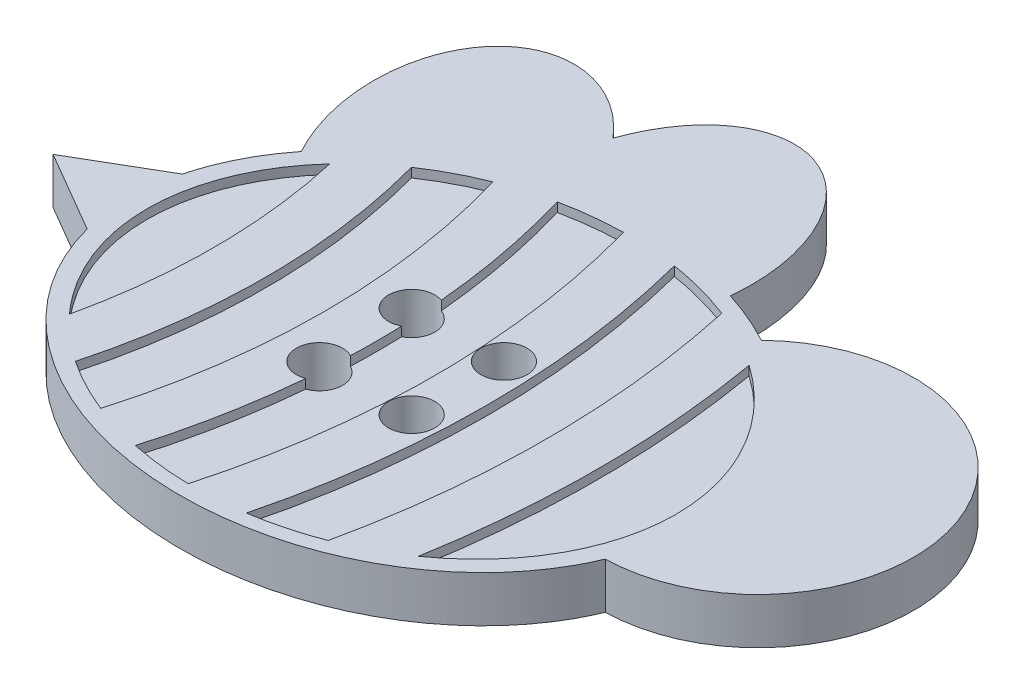
ISO-10303-21;
HEADER;
FILE_DESCRIPTION(('STEP AP214'),'2;1');
FILE_NAME('part.step','',(''),(''),'','','');
FILE_SCHEMA(('AUTOMOTIVE_DESIGN { 1 0 10303 214 1 1 1 1 }'));
ENDSEC;
DATA;
#1=APPLICATION_CONTEXT('core data for automotive mechanical design processes');
#2=APPLICATION_PROTOCOL_DEFINITION('international standard','automotive_design',2000,#1);
#3=PRODUCT_CONTEXT('',#1,'mechanical');
#4=PRODUCT('Part','Part','',(#3));
#5=PRODUCT_RELATED_PRODUCT_CATEGORY('part','',(#4));
#6=PRODUCT_DEFINITION_FORMATION('','',#4);
#7=PRODUCT_DEFINITION_CONTEXT('part definition',#1,'design');
#8=PRODUCT_DEFINITION('design','',#6,#7);
#9=PRODUCT_DEFINITION_SHAPE('','',#8);
#10=(LENGTH_UNIT() NAMED_UNIT(*) SI_UNIT(.MILLI.,.METRE.));
#11=(NAMED_UNIT(*) PLANE_ANGLE_UNIT() SI_UNIT($,.RADIAN.));
#12=(NAMED_UNIT(*) SI_UNIT($,.STERADIAN.) SOLID_ANGLE_UNIT());
#13=UNCERTAINTY_MEASURE_WITH_UNIT(LENGTH_MEASURE(1.E-05),#10,'distance_accuracy_value','');
#14=(GEOMETRIC_REPRESENTATION_CONTEXT(3) GLOBAL_UNCERTAINTY_ASSIGNED_CONTEXT((#13)) GLOBAL_UNIT_ASSIGNED_CONTEXT((#10,
#11,#12)) REPRESENTATION_CONTEXT('',''));
#15=CARTESIAN_POINT('',(0.,0.,0.));
#16=DIRECTION('',(0.,0.,1.));
#17=DIRECTION('',(1.,0.,0.));
#18=AXIS2_PLACEMENT_3D('',#15,#16,#17);
#19=CARTESIAN_POINT('',(-27.1187016034914,1.27,0.));
#20=DIRECTION('',(0.,1.,0.));
#21=DIRECTION('',(0.,0.,1.));
#22=AXIS2_PLACEMENT_3D('',#19,#20,#21);
#23=CYLINDRICAL_SURFACE('',#22,25.908);
#24=CARTESIAN_POINT('',(-27.1187016034914,1.5875,0.));
#25=DIRECTION('',(0.,-1.,0.));
#26=DIRECTION('',(0.,0.,1.));
#27=AXIS2_PLACEMENT_3D('',#24,#25,#26);
#28=CIRCLE('',#27,25.908);
#29=CARTESIAN_POINT('',(-1.22568542497171,1.5875,-0.881009182085779));
#30=VERTEX_POINT('',#29);
#31=CARTESIAN_POINT('',(-1.22568542497171,1.5875,0.881009182085776));
#32=VERTEX_POINT('',#31);
#33=EDGE_CURVE('E437',#30,#32,#28,.T.);
#34=ORIENTED_EDGE('',*,*,#33,.T.);
#35=DIRECTION('',(0.,1.,0.));
#36=VECTOR('',#35,1.);
#37=CARTESIAN_POINT('',(-1.22568542497172,0.793756,0.881009182085778));
#38=LINE('',#37,#36);
#39=CARTESIAN_POINT('',(-1.22568542497171,1.27,0.881009182085765));
#40=VERTEX_POINT('',#39);
#41=EDGE_CURVE('E633',#32,#40,#38,.F.);
#42=ORIENTED_EDGE('',*,*,#41,.T.);
#43=CARTESIAN_POINT('',(-27.1187016034914,1.27,0.));
#44=DIRECTION('',(0.,-1.,0.));
#45=DIRECTION('',(0.,0.,1.));
#46=AXIS2_PLACEMENT_3D('',#43,#44,#45);
#47=CIRCLE('',#46,25.908);
#48=CARTESIAN_POINT('',(-1.22568542497171,1.27,-0.881009182085765));
#49=VERTEX_POINT('',#48);
#50=EDGE_CURVE('E251',#49,#40,#47,.T.);
#51=ORIENTED_EDGE('',*,*,#50,.F.);
#52=DIRECTION('',(0.,1.,0.));
#53=VECTOR('',#52,1.);
#54=CARTESIAN_POINT('',(-1.22568542497172,0.793756,-0.881009182085778));
#55=LINE('',#54,#53);
#56=EDGE_CURVE('E63',#49,#30,#55,.T.);
#57=ORIENTED_EDGE('',*,*,#56,.T.);
#58=EDGE_LOOP('',(#34,#42,#51,#57));
#59=FACE_BOUND('',#58,.T.);
#60=ADVANCED_FACE('F39',(#59),#23,.T.);
#61=CARTESIAN_POINT('',(-2.24892880186877,1.5875,-7.26077577092648));
#62=VERTEX_POINT('',#61);
#63=CARTESIAN_POINT('',(-1.31599151362096,1.5875,-2.33337009882698));
#64=VERTEX_POINT('',#63);
#65=EDGE_CURVE('E241',#62,#64,#28,.T.);
#66=ORIENTED_EDGE('',*,*,#65,.T.);
#67=DIRECTION('',(0.,1.,0.));
#68=VECTOR('',#67,1.);
#69=CARTESIAN_POINT('',(-1.31599151362097,0.793756,-2.33337009882698));
#70=LINE('',#69,#68);
#71=CARTESIAN_POINT('',(-1.31599151362096,1.27,-2.33337009882699));
#72=VERTEX_POINT('',#71);
#73=EDGE_CURVE('E225',#64,#72,#70,.F.);
#74=ORIENTED_EDGE('',*,*,#73,.T.);
#75=CARTESIAN_POINT('',(-2.24892880186877,1.27,-7.26077577092648));
#76=VERTEX_POINT('',#75);
#77=EDGE_CURVE('E238',#76,#72,#47,.T.);
#78=ORIENTED_EDGE('',*,*,#77,.F.);
#79=DIRECTION('',(0.,1.,0.));
#80=VECTOR('',#79,1.);
#81=CARTESIAN_POINT('',(-2.24892880186877,1.27,-7.26077577092648));
#82=LINE('',#81,#80);
#83=EDGE_CURVE('E418',#76,#62,#82,.T.);
#84=ORIENTED_EDGE('',*,*,#83,.T.);
#85=EDGE_LOOP('',(#66,#74,#78,#84));
#86=FACE_BOUND('',#85,.T.);
#87=ADVANCED_FACE('F236',(#86),#23,.T.);
#88=CARTESIAN_POINT('',(0.,1.5875,0.));
#89=DIRECTION('',(0.,1.,0.));
#90=DIRECTION('',(0.,0.,1.));
#91=AXIS2_PLACEMENT_3D('',#88,#89,#90);
#92=PLANE('',#91);
#93=CARTESIAN_POINT('',(-1.5875,1.5875,1.5875));
#94=DIRECTION('',(0.,1.,0.));
#95=DIRECTION('',(0.,0.,1.));
#96=AXIS2_PLACEMENT_3D('',#93,#94,#95);
#97=CIRCLE('',#96,0.79375);
#98=CARTESIAN_POINT('',(-1.31599151362096,1.5875,2.33337009882698));
#99=VERTEX_POINT('',#98);
#100=EDGE_CURVE('E640',#32,#99,#97,.T.);
#101=ORIENTED_EDGE('',*,*,#100,.F.);
#102=ORIENTED_EDGE('',*,*,#33,.F.);
#103=CARTESIAN_POINT('',(-1.5875,1.5875,-1.5875));
#104=DIRECTION('',(0.,1.,0.));
#105=DIRECTION('',(0.,0.,1.));
#106=AXIS2_PLACEMENT_3D('',#103,#104,#105);
#107=CIRCLE('',#106,0.79375);
#108=EDGE_CURVE('E243',#64,#30,#107,.T.);
#109=ORIENTED_EDGE('',*,*,#108,.F.);
#110=ORIENTED_EDGE('',*,*,#65,.F.);
#111=CARTESIAN_POINT('',(0.,1.5875,0.));
#112=DIRECTION('',(0.,1.,0.));
#113=DIRECTION('',(1.,0.,0.));
#114=AXIS2_PLACEMENT_3D('',#111,#112,#113);
#115=ELLIPSE('',#114,9.10545943753928,7.49291504612029);
#116=CARTESIAN_POINT('',(-0.201655679950095,1.5875,-7.49107727566405));
#117=VERTEX_POINT('',#116);
#118=EDGE_CURVE('E439',#117,#62,#115,.T.);
#119=ORIENTED_EDGE('',*,*,#118,.F.);
#120=CARTESIAN_POINT('',(-27.1187016034914,1.5875,0.));
#121=DIRECTION('',(0.,1.,0.));
#122=DIRECTION('',(0.,0.,1.));
#123=AXIS2_PLACEMENT_3D('',#120,#121,#122);
#124=CIRCLE('',#123,27.94);
#125=CARTESIAN_POINT('',(-0.201655679950098,1.5875,7.49107727566404));
#126=VERTEX_POINT('',#125);
#127=EDGE_CURVE('E264',#126,#117,#124,.T.);
#128=ORIENTED_EDGE('',*,*,#127,.F.);
#129=CARTESIAN_POINT('',(0.,1.5875,0.));
#130=DIRECTION('',(0.,1.,0.));
#131=DIRECTION('',(1.,0.,0.));
#132=AXIS2_PLACEMENT_3D('',#129,#130,#131);
#133=ELLIPSE('',#132,9.10545943753928,7.49291504612029);
#134=CARTESIAN_POINT('',(-2.24892880186877,1.5875,7.26077577092648));
#135=VERTEX_POINT('',#134);
#136=EDGE_CURVE('E267',#135,#126,#133,.T.);
#137=ORIENTED_EDGE('',*,*,#136,.F.);
#138=EDGE_CURVE('E438',#99,#135,#28,.T.);
#139=ORIENTED_EDGE('',*,*,#138,.F.);
#140=EDGE_LOOP('',(#101,#102,#109,#110,#119,#128,#137,#139));
#141=FACE_BOUND('',#140,.T.);
#142=CARTESIAN_POINT('',(1.5875,1.5875,1.5875));
#143=DIRECTION('',(0.,1.,0.));
#144=DIRECTION('',(0.,0.,1.));
#145=AXIS2_PLACEMENT_3D('',#142,#143,#144);
#146=CIRCLE('',#145,0.79375);
#147=CARTESIAN_POINT('',(1.5875,1.5875,2.38125));
#148=VERTEX_POINT('',#147);
#149=EDGE_CURVE('E599',#148,#148,#146,.T.);
#150=ORIENTED_EDGE('',*,*,#149,.F.);
#151=EDGE_LOOP('',(#150));
#152=FACE_BOUND('',#151,.T.);
#153=CARTESIAN_POINT('',(1.5875,1.5875,-1.5875));
#154=DIRECTION('',(0.,1.,0.));
#155=DIRECTION('',(0.,0.,1.));
#156=AXIS2_PLACEMENT_3D('',#153,#154,#155);
#157=CIRCLE('',#156,0.79375);
#158=CARTESIAN_POINT('',(1.5875,1.5875,-0.79375));
#159=VERTEX_POINT('',#158);
#160=EDGE_CURVE('E642',#159,#159,#157,.T.);
#161=ORIENTED_EDGE('',*,*,#160,.F.);
#162=EDGE_LOOP('',(#161));
#163=FACE_BOUND('',#162,.T.);
#164=CARTESIAN_POINT('',(0.,1.5875,0.));
#165=DIRECTION('',(0.,1.,0.));
#166=DIRECTION('',(1.,0.,0.));
#167=AXIS2_PLACEMENT_3D('',#164,#165,#166);
#168=ELLIPSE('',#167,9.10545943753928,7.49291504612029);
#169=CARTESIAN_POINT('',(3.90103310837736,1.5875,-6.77041789000403));
#170=VERTEX_POINT('',#169);
#171=CARTESIAN_POINT('',(1.67207837901827,1.5875,-7.36549468798413));
#172=VERTEX_POINT('',#171);
#173=EDGE_CURVE('E649',#170,#172,#168,.T.);
#174=ORIENTED_EDGE('',*,*,#173,.F.);
#175=CARTESIAN_POINT('',(-27.1187016034914,1.5875,0.));
#176=DIRECTION('',(0.,1.,0.));
#177=DIRECTION('',(0.,0.,1.));
#178=AXIS2_PLACEMENT_3D('',#175,#176,#177);
#179=CIRCLE('',#178,31.75);
#180=CARTESIAN_POINT('',(3.90103310837736,1.5875,6.77041789000402));
#181=VERTEX_POINT('',#180);
#182=EDGE_CURVE('E508',#181,#170,#179,.T.);
#183=ORIENTED_EDGE('',*,*,#182,.F.);
#184=CARTESIAN_POINT('',(0.,1.5875,0.));
#185=DIRECTION('',(0.,1.,0.));
#186=DIRECTION('',(1.,0.,0.));
#187=AXIS2_PLACEMENT_3D('',#184,#185,#186);
#188=ELLIPSE('',#187,9.10545943753928,7.49291504612029);
#189=CARTESIAN_POINT('',(1.67207837901827,1.5875,7.36549468798414));
#190=VERTEX_POINT('',#189);
#191=EDGE_CURVE('E658',#190,#181,#188,.T.);
#192=ORIENTED_EDGE('',*,*,#191,.F.);
#193=CARTESIAN_POINT('',(-27.1187016034914,1.5875,0.));
#194=DIRECTION('',(0.,-1.,0.));
#195=DIRECTION('',(0.,0.,1.));
#196=AXIS2_PLACEMENT_3D('',#193,#194,#195);
#197=CIRCLE('',#196,29.718);
#198=EDGE_CURVE('E653',#172,#190,#197,.T.);
#199=ORIENTED_EDGE('',*,*,#198,.F.);
#200=EDGE_LOOP('',(#174,#183,#192,#199));
#201=FACE_BOUND('',#200,.T.);
#202=CARTESIAN_POINT('',(0.,1.5875,0.));
#203=DIRECTION('',(0.,1.,0.));
#204=DIRECTION('',(1.,0.,0.));
#205=AXIS2_PLACEMENT_3D('',#202,#203,#204);
#206=ELLIPSE('',#205,9.73601405971922,7.97996050694144);
#207=CARTESIAN_POINT('',(5.38614208573865,1.5875,-6.64759643350523));
#208=VERTEX_POINT('',#207);
#209=CARTESIAN_POINT('',(3.5320102469503,1.5875,-7.43633090397419));
#210=VERTEX_POINT('',#209);
#211=EDGE_CURVE('E340',#208,#210,#206,.T.);
#212=ORIENTED_EDGE('',*,*,#211,.T.);
#213=CARTESIAN_POINT('',(-9.63275683177334E-12,1.5875,-7.97996050694035));
#214=DIRECTION('',(0.,1.,0.));
#215=DIRECTION('',(-0.0403355597189973,0.,0.999186190167856));
#216=AXIS2_PLACEMENT_3D('',#213,#214,#215);
#217=ELLIPSE('',#216,5.08394519631617,3.56214606486773);
#218=CARTESIAN_POINT('',(-3.18877267087557,1.5875,-10.1185982925658));
#219=VERTEX_POINT('',#218);
#220=EDGE_CURVE('E374',#210,#219,#217,.T.);
#221=ORIENTED_EDGE('',*,*,#220,.T.);
#222=CARTESIAN_POINT('',(-5.30016568849843,1.5875,-6.69386038934538));
#223=DIRECTION('',(0.,1.,0.));
#224=DIRECTION('',(-0.303838776147022,0.,-0.952723463608134));
#225=AXIS2_PLACEMENT_3D('',#222,#223,#224);
#226=ELLIPSE('',#225,5.08394519631616,3.56214606486773);
#227=CARTESIAN_POINT('',(-8.15744938206091,1.5875,-4.35610104468042));
#228=VERTEX_POINT('',#227);
#229=EDGE_CURVE('E399',#219,#228,#226,.T.);
#230=ORIENTED_EDGE('',*,*,#229,.T.);
#231=CARTESIAN_POINT('',(0.,1.5875,0.));
#232=DIRECTION('',(0.,1.,0.));
#233=DIRECTION('',(1.,0.,0.));
#234=AXIS2_PLACEMENT_3D('',#231,#232,#233);
#235=ELLIPSE('',#234,9.73601405971922,7.97996050694144);
#236=CARTESIAN_POINT('',(-9.52836976756592,1.5875,-1.63929498279717));
#237=VERTEX_POINT('',#236);
#238=EDGE_CURVE('E394',#228,#237,#235,.T.);
#239=ORIENTED_EDGE('',*,*,#238,.T.);
#240=DIRECTION('',(-0.863952560592376,0.,0.503573205250118));
#241=VECTOR('',#240,1.);
#242=CARTESIAN_POINT('',(-9.52836976756592,1.5875,-1.63929498279717));
#243=LINE('',#242,#241);
#244=CARTESIAN_POINT('',(-12.3408170606073,1.5875,0.));
#245=VERTEX_POINT('',#244);
#246=EDGE_CURVE('E398',#237,#245,#243,.T.);
#247=ORIENTED_EDGE('',*,*,#246,.T.);
#248=DIRECTION('',(0.863952560592376,0.,0.503573205250118));
#249=VECTOR('',#248,1.);
#250=CARTESIAN_POINT('',(-9.52836976756592,1.5875,1.63929498279717));
#251=LINE('',#250,#249);
#252=CARTESIAN_POINT('',(-9.52836976756592,1.5875,1.63929498279716));
#253=VERTEX_POINT('',#252);
#254=EDGE_CURVE('E309',#245,#253,#251,.T.);
#255=ORIENTED_EDGE('',*,*,#254,.T.);
#256=CARTESIAN_POINT('',(0.,1.5875,0.));
#257=DIRECTION('',(0.,1.,0.));
#258=DIRECTION('',(1.,0.,0.));
#259=AXIS2_PLACEMENT_3D('',#256,#257,#258);
#260=ELLIPSE('',#259,9.73601405971922,7.97996050694144);
#261=CARTESIAN_POINT('',(9.22231940055669,1.5875,2.55783280940252));
#262=VERTEX_POINT('',#261);
#263=EDGE_CURVE('E303',#253,#262,#260,.T.);
#264=ORIENTED_EDGE('',*,*,#263,.T.);
#265=CARTESIAN_POINT('',(9.11688367615167,1.5875,-2.80026842985473));
#266=DIRECTION('',(0.,1.,0.));
#267=DIRECTION('',(0.,0.,1.));
#268=AXIS2_PLACEMENT_3D('',#265,#266,#267);
#269=CIRCLE('',#268,5.35913851118917);
#270=EDGE_CURVE('E308',#262,#208,#269,.T.);
#271=ORIENTED_EDGE('',*,*,#270,.T.);
#272=EDGE_LOOP('',(#212,#221,#230,#239,#247,#255,#264,#271));
#273=FACE_BOUND('',#272,.T.);
#274=CARTESIAN_POINT('',(0.,1.5875,0.));
#275=DIRECTION('',(0.,1.,0.));
#276=DIRECTION('',(1.,0.,0.));
#277=AXIS2_PLACEMENT_3D('',#274,#275,#276);
#278=ELLIPSE('',#277,9.10545943753928,7.49291504612029);
#279=CARTESIAN_POINT('',(-3.95212939326714,1.5875,-6.75032088337039));
#280=VERTEX_POINT('',#279);
#281=CARTESIAN_POINT('',(-5.79067644756145,1.5875,-5.78246893186816));
#282=VERTEX_POINT('',#281);
#283=EDGE_CURVE('E430',#280,#282,#278,.T.);
#284=ORIENTED_EDGE('',*,*,#283,.F.);
#285=CARTESIAN_POINT('',(-27.1187016034914,1.5875,0.));
#286=DIRECTION('',(0.,1.,0.));
#287=DIRECTION('',(0.,0.,1.));
#288=AXIS2_PLACEMENT_3D('',#285,#286,#287);
#289=CIRCLE('',#288,24.13);
#290=CARTESIAN_POINT('',(-3.95212939326714,1.5875,6.75032088337039));
#291=VERTEX_POINT('',#290);
#292=EDGE_CURVE('E469',#291,#280,#289,.T.);
#293=ORIENTED_EDGE('',*,*,#292,.F.);
#294=CARTESIAN_POINT('',(0.,1.5875,0.));
#295=DIRECTION('',(0.,1.,0.));
#296=DIRECTION('',(1.,0.,0.));
#297=AXIS2_PLACEMENT_3D('',#294,#295,#296);
#298=ELLIPSE('',#297,9.10545943753928,7.49291504612029);
#299=CARTESIAN_POINT('',(-5.79067644756145,1.5875,5.78246893186816));
#300=VERTEX_POINT('',#299);
#301=EDGE_CURVE('E696',#300,#291,#298,.T.);
#302=ORIENTED_EDGE('',*,*,#301,.F.);
#303=CARTESIAN_POINT('',(-27.1187016034914,1.5875,0.));
#304=DIRECTION('',(0.,-1.,0.));
#305=DIRECTION('',(0.,0.,1.));
#306=AXIS2_PLACEMENT_3D('',#303,#304,#305);
#307=CIRCLE('',#306,22.098);
#308=EDGE_CURVE('E692',#282,#300,#307,.T.);
#309=ORIENTED_EDGE('',*,*,#308,.F.);
#310=EDGE_LOOP('',(#284,#293,#302,#309));
#311=FACE_BOUND('',#310,.T.);
#312=CARTESIAN_POINT('',(0.,1.5875,0.));
#313=DIRECTION('',(0.,1.,0.));
#314=DIRECTION('',(1.,0.,0.));
#315=AXIS2_PLACEMENT_3D('',#312,#313,#314);
#316=ELLIPSE('',#315,9.10545943753928,7.49291504612029);
#317=CARTESIAN_POINT('',(-7.29870579075242,1.5875,-4.47997388195634));
#318=VERTEX_POINT('',#317);
#319=CARTESIAN_POINT('',(-7.29870579075242,1.5875,4.47997388195634));
#320=VERTEX_POINT('',#319);
#321=EDGE_CURVE('E552',#318,#320,#316,.T.);
#322=ORIENTED_EDGE('',*,*,#321,.F.);
#323=CARTESIAN_POINT('',(-27.1187016034914,1.5875,0.));
#324=DIRECTION('',(0.,1.,0.));
#325=DIRECTION('',(0.,0.,1.));
#326=AXIS2_PLACEMENT_3D('',#323,#324,#325);
#327=CIRCLE('',#326,20.32);
#328=EDGE_CURVE('E546',#320,#318,#327,.T.);
#329=ORIENTED_EDGE('',*,*,#328,.F.);
#330=EDGE_LOOP('',(#322,#329));
#331=FACE_BOUND('',#330,.T.);
#332=CARTESIAN_POINT('',(0.,1.5875,0.));
#333=DIRECTION('',(0.,1.,0.));
#334=DIRECTION('',(1.,0.,0.));
#335=AXIS2_PLACEMENT_3D('',#332,#333,#334);
#336=ELLIPSE('',#335,9.10545943753928,7.49291504612029);
#337=CARTESIAN_POINT('',(5.92274859331707,1.5875,5.69116445833608));
#338=VERTEX_POINT('',#337);
#339=CARTESIAN_POINT('',(5.92274859331707,1.5875,-5.69116445833608));
#340=VERTEX_POINT('',#339);
#341=EDGE_CURVE('E570',#338,#340,#336,.T.);
#342=ORIENTED_EDGE('',*,*,#341,.F.);
#343=CARTESIAN_POINT('',(-27.1187016034914,1.5875,0.));
#344=DIRECTION('',(0.,-1.,0.));
#345=DIRECTION('',(0.,0.,1.));
#346=AXIS2_PLACEMENT_3D('',#343,#344,#345);
#347=CIRCLE('',#346,33.528);
#348=EDGE_CURVE('E572',#340,#338,#347,.T.);
#349=ORIENTED_EDGE('',*,*,#348,.F.);
#350=EDGE_LOOP('',(#342,#349));
#351=FACE_BOUND('',#350,.T.);
#352=ADVANCED_FACE('F283',(#141,#152,#163,#201,#273,#311,#331,#351),#92,.T.);
#353=DIRECTION('',(0.,-1.,0.));
#354=VECTOR('',#353,1.);
#355=SURFACE_OF_LINEAR_EXTRUSION('',#206,#354);
#356=CARTESIAN_POINT('',(0.,0.,0.));
#357=DIRECTION('',(0.,1.,0.));
#358=DIRECTION('',(1.,0.,0.));
#359=AXIS2_PLACEMENT_3D('',#356,#357,#358);
#360=ELLIPSE('',#359,9.73601405971922,7.97996050694144);
#361=CARTESIAN_POINT('',(5.38614208573865,0.,-6.64759643350523));
#362=VERTEX_POINT('',#361);
#363=CARTESIAN_POINT('',(3.5320102469503,0.,-7.43633090397419));
#364=VERTEX_POINT('',#363);
#365=EDGE_CURVE('E314',#362,#364,#360,.T.);
#366=ORIENTED_EDGE('',*,*,#365,.T.);
#367=DIRECTION('',(0.,-1.,0.));
#368=VECTOR('',#367,1.);
#369=CARTESIAN_POINT('',(3.5320102469503,1.5875,-7.43633090397419));
#370=LINE('',#369,#368);
#371=EDGE_CURVE('E232',#210,#364,#370,.T.);
#372=ORIENTED_EDGE('',*,*,#371,.F.);
#373=ORIENTED_EDGE('',*,*,#211,.F.);
#374=DIRECTION('',(0.,-1.,0.));
#375=VECTOR('',#374,1.);
#376=CARTESIAN_POINT('',(5.38614208573865,1.5875,-6.64759643350523));
#377=LINE('',#376,#375);
#378=EDGE_CURVE('E313',#208,#362,#377,.T.);
#379=ORIENTED_EDGE('',*,*,#378,.T.);
#380=EDGE_LOOP('',(#366,#372,#373,#379));
#381=FACE_BOUND('',#380,.T.);
#382=ADVANCED_FACE('F41',(#381),#355,.F.);
#383=DIRECTION('',(0.,-1.,0.));
#384=VECTOR('',#383,1.);
#385=SURFACE_OF_LINEAR_EXTRUSION('',#217,#384);
#386=CARTESIAN_POINT('',(-9.63275683177334E-12,0.,-7.97996050694035));
#387=DIRECTION('',(0.,1.,0.));
#388=DIRECTION('',(-0.0403355597189973,0.,0.999186190167856));
#389=AXIS2_PLACEMENT_3D('',#386,#387,#388);
#390=ELLIPSE('',#389,5.08394519631617,3.56214606486773);
#391=CARTESIAN_POINT('',(-3.18877267087557,0.,-10.1185982925658));
#392=VERTEX_POINT('',#391);
#393=EDGE_CURVE('E318',#364,#392,#390,.T.);
#394=ORIENTED_EDGE('',*,*,#393,.T.);
#395=DIRECTION('',(0.,-1.,0.));
#396=VECTOR('',#395,1.);
#397=CARTESIAN_POINT('',(-3.18877267087557,1.5875,-10.1185982925658));
#398=LINE('',#397,#396);
#399=EDGE_CURVE('E364',#219,#392,#398,.T.);
#400=ORIENTED_EDGE('',*,*,#399,.F.);
#401=ORIENTED_EDGE('',*,*,#220,.F.);
#402=ORIENTED_EDGE('',*,*,#371,.T.);
#403=EDGE_LOOP('',(#394,#400,#401,#402));
#404=FACE_BOUND('',#403,.T.);
#405=ADVANCED_FACE('F372',(#404),#385,.F.);
#406=DIRECTION('',(0.,-1.,0.));
#407=VECTOR('',#406,1.);
#408=SURFACE_OF_LINEAR_EXTRUSION('',#226,#407);
#409=CARTESIAN_POINT('',(-5.30016568849843,0.,-6.69386038934538));
#410=DIRECTION('',(0.,1.,0.));
#411=DIRECTION('',(-0.303838776147022,0.,-0.952723463608134));
#412=AXIS2_PLACEMENT_3D('',#409,#410,#411);
#413=ELLIPSE('',#412,5.08394519631616,3.56214606486773);
#414=CARTESIAN_POINT('',(-8.15744938206091,0.,-4.35610104468042));
#415=VERTEX_POINT('',#414);
#416=EDGE_CURVE('E322',#392,#415,#413,.T.);
#417=ORIENTED_EDGE('',*,*,#416,.T.);
#418=DIRECTION('',(0.,-1.,0.));
#419=VECTOR('',#418,1.);
#420=CARTESIAN_POINT('',(-8.15744938206091,1.5875,-4.35610104468042));
#421=LINE('',#420,#419);
#422=EDGE_CURVE('E360',#228,#415,#421,.T.);
#423=ORIENTED_EDGE('',*,*,#422,.F.);
#424=ORIENTED_EDGE('',*,*,#229,.F.);
#425=ORIENTED_EDGE('',*,*,#399,.T.);
#426=EDGE_LOOP('',(#417,#423,#424,#425));
#427=FACE_BOUND('',#426,.T.);
#428=ADVANCED_FACE('F388',(#427),#408,.F.);
#429=DIRECTION('',(0.,-1.,0.));
#430=VECTOR('',#429,1.);
#431=SURFACE_OF_LINEAR_EXTRUSION('',#235,#430);
#432=CARTESIAN_POINT('',(0.,0.,0.));
#433=DIRECTION('',(0.,1.,0.));
#434=DIRECTION('',(1.,0.,0.));
#435=AXIS2_PLACEMENT_3D('',#432,#433,#434);
#436=ELLIPSE('',#435,9.73601405971922,7.97996050694144);
#437=CARTESIAN_POINT('',(-9.52836976756592,0.,-1.63929498279717));
#438=VERTEX_POINT('',#437);
#439=EDGE_CURVE('E325',#415,#438,#436,.T.);
#440=ORIENTED_EDGE('',*,*,#439,.T.);
#441=DIRECTION('',(0.,-1.,0.));
#442=VECTOR('',#441,1.);
#443=CARTESIAN_POINT('',(-9.52836976756592,1.5875,-1.63929498279717));
#444=LINE('',#443,#442);
#445=EDGE_CURVE('E356',#237,#438,#444,.T.);
#446=ORIENTED_EDGE('',*,*,#445,.F.);
#447=ORIENTED_EDGE('',*,*,#238,.F.);
#448=ORIENTED_EDGE('',*,*,#422,.T.);
#449=EDGE_LOOP('',(#440,#446,#447,#448));
#450=FACE_BOUND('',#449,.T.);
#451=ADVANCED_FACE('F392',(#450),#431,.F.);
#452=CARTESIAN_POINT('',(-9.52836976756592,1.5875,-1.63929498279717));
#453=DIRECTION('',(0.503573205250118,0.,0.863952560592376));
#454=DIRECTION('',(0.863952560592376,0.,-0.503573205250118));
#455=AXIS2_PLACEMENT_3D('',#452,#453,#454);
#456=PLANE('',#455);
#457=DIRECTION('',(-0.863952560592376,0.,0.503573205250118));
#458=VECTOR('',#457,1.);
#459=CARTESIAN_POINT('',(-9.52836976756592,0.,-1.63929498279717));
#460=LINE('',#459,#458);
#461=CARTESIAN_POINT('',(-12.3408170606073,0.,0.));
#462=VERTEX_POINT('',#461);
#463=EDGE_CURVE('E328',#438,#462,#460,.T.);
#464=ORIENTED_EDGE('',*,*,#463,.T.);
#465=DIRECTION('',(0.,-1.,0.));
#466=VECTOR('',#465,1.);
#467=CARTESIAN_POINT('',(-12.3408170606073,1.5875,0.));
#468=LINE('',#467,#466);
#469=EDGE_CURVE('E352',#245,#462,#468,.T.);
#470=ORIENTED_EDGE('',*,*,#469,.F.);
#471=ORIENTED_EDGE('',*,*,#246,.F.);
#472=ORIENTED_EDGE('',*,*,#445,.T.);
#473=EDGE_LOOP('',(#464,#470,#471,#472));
#474=FACE_BOUND('',#473,.T.);
#475=ADVANCED_FACE('F410',(#474),#456,.F.);
#476=CARTESIAN_POINT('',(-9.52836976756592,1.5875,1.63929498279717));
#477=DIRECTION('',(0.503573205250118,0.,-0.863952560592376));
#478=DIRECTION('',(-0.863952560592376,0.,-0.503573205250118));
#479=AXIS2_PLACEMENT_3D('',#476,#477,#478);
#480=PLANE('',#479);
#481=DIRECTION('',(0.863952560592376,0.,0.503573205250118));
#482=VECTOR('',#481,1.);
#483=CARTESIAN_POINT('',(-9.52836976756592,0.,1.63929498279717));
#484=LINE('',#483,#482);
#485=CARTESIAN_POINT('',(-9.52836976756592,0.,1.63929498279716));
#486=VERTEX_POINT('',#485);
#487=EDGE_CURVE('E331',#462,#486,#484,.T.);
#488=ORIENTED_EDGE('',*,*,#487,.T.);
#489=DIRECTION('',(0.,-1.,0.));
#490=VECTOR('',#489,1.);
#491=CARTESIAN_POINT('',(-9.52836976756592,1.5875,1.63929498279716));
#492=LINE('',#491,#490);
#493=EDGE_CURVE('E348',#253,#486,#492,.T.);
#494=ORIENTED_EDGE('',*,*,#493,.F.);
#495=ORIENTED_EDGE('',*,*,#254,.F.);
#496=ORIENTED_EDGE('',*,*,#469,.T.);
#497=EDGE_LOOP('',(#488,#494,#495,#496));
#498=FACE_BOUND('',#497,.T.);
#499=ADVANCED_FACE('F300',(#498),#480,.F.);
#500=DIRECTION('',(0.,-1.,0.));
#501=VECTOR('',#500,1.);
#502=SURFACE_OF_LINEAR_EXTRUSION('',#260,#501);
#503=CARTESIAN_POINT('',(0.,0.,0.));
#504=DIRECTION('',(0.,1.,0.));
#505=DIRECTION('',(1.,0.,0.));
#506=AXIS2_PLACEMENT_3D('',#503,#504,#505);
#507=ELLIPSE('',#506,9.73601405971922,7.97996050694144);
#508=CARTESIAN_POINT('',(9.22231940055669,0.,2.55783280940252));
#509=VERTEX_POINT('',#508);
#510=EDGE_CURVE('E334',#486,#509,#507,.T.);
#511=ORIENTED_EDGE('',*,*,#510,.T.);
#512=DIRECTION('',(0.,-1.,0.));
#513=VECTOR('',#512,1.);
#514=CARTESIAN_POINT('',(9.22231940055669,1.5875,2.55783280940252));
#515=LINE('',#514,#513);
#516=EDGE_CURVE('E344',#262,#509,#515,.T.);
#517=ORIENTED_EDGE('',*,*,#516,.F.);
#518=ORIENTED_EDGE('',*,*,#263,.F.);
#519=ORIENTED_EDGE('',*,*,#493,.T.);
#520=EDGE_LOOP('',(#511,#517,#518,#519));
#521=FACE_BOUND('',#520,.T.);
#522=ADVANCED_FACE('F295',(#521),#502,.F.);
#523=CARTESIAN_POINT('',(9.11688367615167,1.5875,-2.80026842985473));
#524=DIRECTION('',(0.,-1.,0.));
#525=DIRECTION('',(0.,0.,-1.));
#526=AXIS2_PLACEMENT_3D('',#523,#524,#525);
#527=CYLINDRICAL_SURFACE('',#526,5.35913851118917);
#528=CARTESIAN_POINT('',(9.11688367615167,0.,-2.80026842985473));
#529=DIRECTION('',(0.,1.,0.));
#530=DIRECTION('',(0.,0.,1.));
#531=AXIS2_PLACEMENT_3D('',#528,#529,#530);
#532=CIRCLE('',#531,5.35913851118917);
#533=EDGE_CURVE('E337',#509,#362,#532,.T.);
#534=ORIENTED_EDGE('',*,*,#533,.T.);
#535=ORIENTED_EDGE('',*,*,#378,.F.);
#536=ORIENTED_EDGE('',*,*,#270,.F.);
#537=ORIENTED_EDGE('',*,*,#516,.T.);
#538=EDGE_LOOP('',(#534,#535,#536,#537));
#539=FACE_BOUND('',#538,.T.);
#540=ADVANCED_FACE('F291',(#539),#527,.T.);
#541=CARTESIAN_POINT('',(0.,0.,0.));
#542=DIRECTION('',(0.,1.,0.));
#543=DIRECTION('',(0.,0.,1.));
#544=AXIS2_PLACEMENT_3D('',#541,#542,#543);
#545=PLANE('',#544);
#546=CARTESIAN_POINT('',(-1.5875,0.,1.5875));
#547=DIRECTION('',(0.,1.,0.));
#548=DIRECTION('',(0.,0.,-1.));
#549=AXIS2_PLACEMENT_3D('',#546,#547,#548);
#550=CIRCLE('',#549,0.79375);
#551=CARTESIAN_POINT('',(-1.5875,0.,0.79375));
#552=VERTEX_POINT('',#551);
#553=EDGE_CURVE('E885',#552,#552,#550,.T.);
#554=ORIENTED_EDGE('',*,*,#553,.T.);
#555=EDGE_LOOP('',(#554));
#556=FACE_BOUND('',#555,.T.);
#557=CARTESIAN_POINT('',(1.5875,0.,1.5875));
#558=DIRECTION('',(0.,1.,0.));
#559=DIRECTION('',(0.,0.,1.));
#560=AXIS2_PLACEMENT_3D('',#557,#558,#559);
#561=CIRCLE('',#560,0.79375);
#562=CARTESIAN_POINT('',(1.5875,0.,2.38125));
#563=VERTEX_POINT('',#562);
#564=EDGE_CURVE('E881',#563,#563,#561,.T.);
#565=ORIENTED_EDGE('',*,*,#564,.T.);
#566=EDGE_LOOP('',(#565));
#567=FACE_BOUND('',#566,.T.);
#568=CARTESIAN_POINT('',(1.5875,0.,-1.5875));
#569=DIRECTION('',(0.,1.,0.));
#570=DIRECTION('',(0.,0.,-1.));
#571=AXIS2_PLACEMENT_3D('',#568,#569,#570);
#572=CIRCLE('',#571,0.79375);
#573=CARTESIAN_POINT('',(1.5875,0.,-2.38125));
#574=VERTEX_POINT('',#573);
#575=EDGE_CURVE('E884',#574,#574,#572,.T.);
#576=ORIENTED_EDGE('',*,*,#575,.T.);
#577=EDGE_LOOP('',(#576));
#578=FACE_BOUND('',#577,.T.);
#579=CARTESIAN_POINT('',(-1.5875,0.,-1.5875));
#580=DIRECTION('',(0.,1.,0.));
#581=DIRECTION('',(0.,0.,1.));
#582=AXIS2_PLACEMENT_3D('',#579,#580,#581);
#583=CIRCLE('',#582,0.79375);
#584=CARTESIAN_POINT('',(-1.5875,0.,-0.79375));
#585=VERTEX_POINT('',#584);
#586=EDGE_CURVE('E890',#585,#585,#583,.T.);
#587=ORIENTED_EDGE('',*,*,#586,.T.);
#588=EDGE_LOOP('',(#587));
#589=FACE_BOUND('',#588,.T.);
#590=ORIENTED_EDGE('',*,*,#365,.F.);
#591=ORIENTED_EDGE('',*,*,#533,.F.);
#592=ORIENTED_EDGE('',*,*,#510,.F.);
#593=ORIENTED_EDGE('',*,*,#487,.F.);
#594=ORIENTED_EDGE('',*,*,#463,.F.);
#595=ORIENTED_EDGE('',*,*,#439,.F.);
#596=ORIENTED_EDGE('',*,*,#416,.F.);
#597=ORIENTED_EDGE('',*,*,#393,.F.);
#598=EDGE_LOOP('',(#590,#591,#592,#593,#594,#595,#596,#597));
#599=FACE_BOUND('',#598,.T.);
#600=ADVANCED_FACE('F287',(#556,#567,#578,#589,#599),#545,.F.);
#601=CARTESIAN_POINT('',(0.,1.27,0.));
#602=DIRECTION('',(0.,1.,0.));
#603=DIRECTION('',(1.,0.,0.));
#604=AXIS2_PLACEMENT_3D('',#601,#602,#603);
#605=ELLIPSE('',#604,9.10545943753928,7.49291504612029);
#606=DIRECTION('',(0.,1.,0.));
#607=VECTOR('',#606,1.);
#608=SURFACE_OF_LINEAR_EXTRUSION('',#605,#607);
#609=ORIENTED_EDGE('',*,*,#283,.T.);
#610=DIRECTION('',(0.,1.,0.));
#611=VECTOR('',#610,1.);
#612=CARTESIAN_POINT('',(-5.79067644756145,1.27,-5.78246893186816));
#613=LINE('',#612,#611);
#614=CARTESIAN_POINT('',(-5.79067644756145,1.27,-5.78246893186816));
#615=VERTEX_POINT('',#614);
#616=EDGE_CURVE('E271',#615,#282,#613,.T.);
#617=ORIENTED_EDGE('',*,*,#616,.F.);
#618=CARTESIAN_POINT('',(-3.95212939326714,1.27,-6.75032088337039));
#619=VERTEX_POINT('',#618);
#620=EDGE_CURVE('E462',#619,#615,#605,.T.);
#621=ORIENTED_EDGE('',*,*,#620,.F.);
#622=DIRECTION('',(0.,1.,0.));
#623=VECTOR('',#622,1.);
#624=CARTESIAN_POINT('',(-3.95212939326714,1.27,-6.75032088337039));
#625=LINE('',#624,#623);
#626=EDGE_CURVE('E576',#619,#280,#625,.T.);
#627=ORIENTED_EDGE('',*,*,#626,.T.);
#628=EDGE_LOOP('',(#609,#617,#621,#627));
#629=FACE_BOUND('',#628,.T.);
#630=ADVANCED_FACE('F290',(#629),#608,.F.);
#631=CARTESIAN_POINT('',(-27.1187016034914,1.27,0.));
#632=DIRECTION('',(0.,1.,0.));
#633=DIRECTION('',(0.,0.,1.));
#634=AXIS2_PLACEMENT_3D('',#631,#632,#633);
#635=CYLINDRICAL_SURFACE('',#634,24.13);
#636=ORIENTED_EDGE('',*,*,#292,.T.);
#637=ORIENTED_EDGE('',*,*,#626,.F.);
#638=CARTESIAN_POINT('',(-27.1187016034914,1.27,0.));
#639=DIRECTION('',(0.,1.,0.));
#640=DIRECTION('',(0.,0.,1.));
#641=AXIS2_PLACEMENT_3D('',#638,#639,#640);
#642=CIRCLE('',#641,24.13);
#643=CARTESIAN_POINT('',(-3.95212939326714,1.27,6.75032088337039));
#644=VERTEX_POINT('',#643);
#645=EDGE_CURVE('E480',#644,#619,#642,.T.);
#646=ORIENTED_EDGE('',*,*,#645,.F.);
#647=DIRECTION('',(0.,1.,0.));
#648=VECTOR('',#647,1.);
#649=CARTESIAN_POINT('',(-3.95212939326714,1.27,6.75032088337039));
#650=LINE('',#649,#648);
#651=EDGE_CURVE('E582',#644,#291,#650,.T.);
#652=ORIENTED_EDGE('',*,*,#651,.T.);
#653=EDGE_LOOP('',(#636,#637,#646,#652));
#654=FACE_BOUND('',#653,.T.);
#655=ADVANCED_FACE('F458',(#654),#635,.F.);
#656=CARTESIAN_POINT('',(0.,1.27,0.));
#657=DIRECTION('',(0.,1.,0.));
#658=DIRECTION('',(1.,0.,0.));
#659=AXIS2_PLACEMENT_3D('',#656,#657,#658);
#660=ELLIPSE('',#659,9.10545943753928,7.49291504612029);
#661=DIRECTION('',(0.,1.,0.));
#662=VECTOR('',#661,1.);
#663=SURFACE_OF_LINEAR_EXTRUSION('',#660,#662);
#664=ORIENTED_EDGE('',*,*,#301,.T.);
#665=ORIENTED_EDGE('',*,*,#651,.F.);
#666=CARTESIAN_POINT('',(-5.79067644756145,1.27,5.78246893186816));
#667=VERTEX_POINT('',#666);
#668=EDGE_CURVE('E475',#667,#644,#660,.T.);
#669=ORIENTED_EDGE('',*,*,#668,.F.);
#670=DIRECTION('',(0.,1.,0.));
#671=VECTOR('',#670,1.);
#672=CARTESIAN_POINT('',(-5.79067644756145,1.27,5.78246893186816));
#673=LINE('',#672,#671);
#674=EDGE_CURVE('E705',#667,#300,#673,.T.);
#675=ORIENTED_EDGE('',*,*,#674,.T.);
#676=EDGE_LOOP('',(#664,#665,#669,#675));
#677=FACE_BOUND('',#676,.T.);
#678=ADVANCED_FACE('F482',(#677),#663,.F.);
#679=CARTESIAN_POINT('',(-27.1187016034914,1.27,0.));
#680=DIRECTION('',(0.,1.,0.));
#681=DIRECTION('',(0.,0.,1.));
#682=AXIS2_PLACEMENT_3D('',#679,#680,#681);
#683=CYLINDRICAL_SURFACE('',#682,22.098);
#684=ORIENTED_EDGE('',*,*,#308,.T.);
#685=ORIENTED_EDGE('',*,*,#674,.F.);
#686=CARTESIAN_POINT('',(-27.1187016034914,1.27,0.));
#687=DIRECTION('',(0.,-1.,0.));
#688=DIRECTION('',(0.,0.,1.));
#689=AXIS2_PLACEMENT_3D('',#686,#687,#688);
#690=CIRCLE('',#689,22.098);
#691=EDGE_CURVE('E468',#615,#667,#690,.T.);
#692=ORIENTED_EDGE('',*,*,#691,.F.);
#693=ORIENTED_EDGE('',*,*,#616,.T.);
#694=EDGE_LOOP('',(#684,#685,#692,#693));
#695=FACE_BOUND('',#694,.T.);
#696=ADVANCED_FACE('F460',(#695),#683,.T.);
#697=CARTESIAN_POINT('',(0.,1.27,0.));
#698=DIRECTION('',(0.,1.,0.));
#699=DIRECTION('',(0.,0.,1.));
#700=AXIS2_PLACEMENT_3D('',#697,#698,#699);
#701=PLANE('',#700);
#702=ORIENTED_EDGE('',*,*,#620,.T.);
#703=ORIENTED_EDGE('',*,*,#691,.T.);
#704=ORIENTED_EDGE('',*,*,#668,.T.);
#705=ORIENTED_EDGE('',*,*,#645,.T.);
#706=EDGE_LOOP('',(#702,#703,#704,#705));
#707=FACE_BOUND('',#706,.T.);
#708=ADVANCED_FACE('F279',(#707),#701,.T.);
#709=CARTESIAN_POINT('',(0.,1.27,0.));
#710=DIRECTION('',(0.,1.,0.));
#711=DIRECTION('',(1.,0.,0.));
#712=AXIS2_PLACEMENT_3D('',#709,#710,#711);
#713=ELLIPSE('',#712,9.10545943753928,7.49291504612029);
#714=DIRECTION('',(0.,1.,0.));
#715=VECTOR('',#714,1.);
#716=SURFACE_OF_LINEAR_EXTRUSION('',#713,#715);
#717=ORIENTED_EDGE('',*,*,#118,.T.);
#718=ORIENTED_EDGE('',*,*,#83,.F.);
#719=CARTESIAN_POINT('',(-0.201655679950095,1.27,-7.49107727566405));
#720=VERTEX_POINT('',#719);
#721=EDGE_CURVE('E248',#720,#76,#713,.T.);
#722=ORIENTED_EDGE('',*,*,#721,.F.);
#723=DIRECTION('',(0.,1.,0.));
#724=VECTOR('',#723,1.);
#725=CARTESIAN_POINT('',(-0.201655679950095,1.27,-7.49107727566405));
#726=LINE('',#725,#724);
#727=EDGE_CURVE('E428',#720,#117,#726,.T.);
#728=ORIENTED_EDGE('',*,*,#727,.T.);
#729=EDGE_LOOP('',(#717,#718,#722,#728));
#730=FACE_BOUND('',#729,.T.);
#731=ADVANCED_FACE('F274',(#730),#716,.F.);
#732=CARTESIAN_POINT('',(-27.1187016034914,1.27,0.));
#733=DIRECTION('',(0.,1.,0.));
#734=DIRECTION('',(0.,0.,1.));
#735=AXIS2_PLACEMENT_3D('',#732,#733,#734);
#736=CYLINDRICAL_SURFACE('',#735,27.94);
#737=ORIENTED_EDGE('',*,*,#127,.T.);
#738=ORIENTED_EDGE('',*,*,#727,.F.);
#739=CARTESIAN_POINT('',(-27.1187016034914,1.27,0.));
#740=DIRECTION('',(0.,1.,0.));
#741=DIRECTION('',(0.,0.,1.));
#742=AXIS2_PLACEMENT_3D('',#739,#740,#741);
#743=CIRCLE('',#742,27.94);
#744=CARTESIAN_POINT('',(-0.201655679950098,1.27,7.49107727566404));
#745=VERTEX_POINT('',#744);
#746=EDGE_CURVE('E257',#745,#720,#743,.T.);
#747=ORIENTED_EDGE('',*,*,#746,.F.);
#748=DIRECTION('',(0.,1.,0.));
#749=VECTOR('',#748,1.);
#750=CARTESIAN_POINT('',(-0.201655679950098,1.27,7.49107727566404));
#751=LINE('',#750,#749);
#752=EDGE_CURVE('E425',#745,#126,#751,.T.);
#753=ORIENTED_EDGE('',*,*,#752,.T.);
#754=EDGE_LOOP('',(#737,#738,#747,#753));
#755=FACE_BOUND('',#754,.T.);
#756=ADVANCED_FACE('F278',(#755),#736,.F.);
#757=CARTESIAN_POINT('',(0.,1.27,0.));
#758=DIRECTION('',(0.,1.,0.));
#759=DIRECTION('',(1.,0.,0.));
#760=AXIS2_PLACEMENT_3D('',#757,#758,#759);
#761=ELLIPSE('',#760,9.10545943753928,7.49291504612029);
#762=DIRECTION('',(0.,1.,0.));
#763=VECTOR('',#762,1.);
#764=SURFACE_OF_LINEAR_EXTRUSION('',#761,#763);
#765=ORIENTED_EDGE('',*,*,#136,.T.);
#766=ORIENTED_EDGE('',*,*,#752,.F.);
#767=CARTESIAN_POINT('',(-2.24892880186877,1.27,7.26077577092648));
#768=VERTEX_POINT('',#767);
#769=EDGE_CURVE('E250',#768,#745,#761,.T.);
#770=ORIENTED_EDGE('',*,*,#769,.F.);
#771=DIRECTION('',(0.,1.,0.));
#772=VECTOR('',#771,1.);
#773=CARTESIAN_POINT('',(-2.24892880186877,1.27,7.26077577092648));
#774=LINE('',#773,#772);
#775=EDGE_CURVE('E421',#768,#135,#774,.T.);
#776=ORIENTED_EDGE('',*,*,#775,.T.);
#777=EDGE_LOOP('',(#765,#766,#770,#776));
#778=FACE_BOUND('',#777,.T.);
#779=ADVANCED_FACE('F445',(#778),#764,.F.);
#780=CARTESIAN_POINT('',(-1.31599151362096,1.27,2.33337009882699));
#781=VERTEX_POINT('',#780);
#782=EDGE_CURVE('E253',#781,#768,#47,.T.);
#783=ORIENTED_EDGE('',*,*,#782,.F.);
#784=DIRECTION('',(0.,1.,0.));
#785=VECTOR('',#784,1.);
#786=CARTESIAN_POINT('',(-1.31599151362097,0.793756,2.33337009882698));
#787=LINE('',#786,#785);
#788=EDGE_CURVE('E55',#781,#99,#787,.T.);
#789=ORIENTED_EDGE('',*,*,#788,.T.);
#790=ORIENTED_EDGE('',*,*,#138,.T.);
#791=ORIENTED_EDGE('',*,*,#775,.F.);
#792=EDGE_LOOP('',(#783,#789,#790,#791));
#793=FACE_BOUND('',#792,.T.);
#794=ADVANCED_FACE('F281',(#793),#23,.T.);
#795=CARTESIAN_POINT('',(0.,1.27,0.));
#796=DIRECTION('',(0.,1.,0.));
#797=DIRECTION('',(0.,0.,1.));
#798=AXIS2_PLACEMENT_3D('',#795,#796,#797);
#799=PLANE('',#798);
#800=CARTESIAN_POINT('',(-1.5875,1.27,1.5875));
#801=DIRECTION('',(0.,1.,0.));
#802=DIRECTION('',(0.,0.,1.));
#803=AXIS2_PLACEMENT_3D('',#800,#801,#802);
#804=CIRCLE('',#803,0.79375);
#805=EDGE_CURVE('E11',#781,#40,#804,.T.);
#806=ORIENTED_EDGE('',*,*,#805,.F.);
#807=ORIENTED_EDGE('',*,*,#782,.T.);
#808=ORIENTED_EDGE('',*,*,#769,.T.);
#809=ORIENTED_EDGE('',*,*,#746,.T.);
#810=ORIENTED_EDGE('',*,*,#721,.T.);
#811=ORIENTED_EDGE('',*,*,#77,.T.);
#812=CARTESIAN_POINT('',(-1.5875,1.27,-1.5875));
#813=DIRECTION('',(0.,1.,0.));
#814=DIRECTION('',(0.,0.,1.));
#815=AXIS2_PLACEMENT_3D('',#812,#813,#814);
#816=CIRCLE('',#815,0.79375);
#817=EDGE_CURVE('E49',#49,#72,#816,.T.);
#818=ORIENTED_EDGE('',*,*,#817,.F.);
#819=ORIENTED_EDGE('',*,*,#50,.T.);
#820=EDGE_LOOP('',(#806,#807,#808,#809,#810,#811,#818,#819));
#821=FACE_BOUND('',#820,.T.);
#822=ADVANCED_FACE('F245',(#821),#799,.T.);
#823=CARTESIAN_POINT('',(0.,1.27,0.));
#824=DIRECTION('',(0.,1.,0.));
#825=DIRECTION('',(1.,0.,0.));
#826=AXIS2_PLACEMENT_3D('',#823,#824,#825);
#827=ELLIPSE('',#826,9.10545943753928,7.49291504612029);
#828=DIRECTION('',(0.,1.,0.));
#829=VECTOR('',#828,1.);
#830=SURFACE_OF_LINEAR_EXTRUSION('',#827,#829);
#831=ORIENTED_EDGE('',*,*,#321,.T.);
#832=DIRECTION('',(0.,1.,0.));
#833=VECTOR('',#832,1.);
#834=CARTESIAN_POINT('',(-7.29870579075242,1.27,4.47997388195634));
#835=LINE('',#834,#833);
#836=CARTESIAN_POINT('',(-7.29870579075242,1.27,4.47997388195634));
#837=VERTEX_POINT('',#836);
#838=EDGE_CURVE('E509',#837,#320,#835,.T.);
#839=ORIENTED_EDGE('',*,*,#838,.F.);
#840=CARTESIAN_POINT('',(-7.29870579075242,1.27,-4.47997388195634));
#841=VERTEX_POINT('',#840);
#842=EDGE_CURVE('E539',#841,#837,#827,.T.);
#843=ORIENTED_EDGE('',*,*,#842,.F.);
#844=DIRECTION('',(0.,1.,0.));
#845=VECTOR('',#844,1.);
#846=CARTESIAN_POINT('',(-7.29870579075242,1.27,-4.47997388195634));
#847=LINE('',#846,#845);
#848=EDGE_CURVE('E442',#841,#318,#847,.T.);
#849=ORIENTED_EDGE('',*,*,#848,.T.);
#850=EDGE_LOOP('',(#831,#839,#843,#849));
#851=FACE_BOUND('',#850,.T.);
#852=ADVANCED_FACE('F454',(#851),#830,.F.);
#853=CARTESIAN_POINT('',(-27.1187016034914,1.27,0.));
#854=DIRECTION('',(0.,1.,0.));
#855=DIRECTION('',(0.,0.,1.));
#856=AXIS2_PLACEMENT_3D('',#853,#854,#855);
#857=CYLINDRICAL_SURFACE('',#856,20.32);
#858=ORIENTED_EDGE('',*,*,#328,.T.);
#859=ORIENTED_EDGE('',*,*,#848,.F.);
#860=CARTESIAN_POINT('',(-27.1187016034914,1.27,0.));
#861=DIRECTION('',(0.,1.,0.));
#862=DIRECTION('',(0.,0.,1.));
#863=AXIS2_PLACEMENT_3D('',#860,#861,#862);
#864=CIRCLE('',#863,20.32);
#865=EDGE_CURVE('E545',#837,#841,#864,.T.);
#866=ORIENTED_EDGE('',*,*,#865,.F.);
#867=ORIENTED_EDGE('',*,*,#838,.T.);
#868=EDGE_LOOP('',(#858,#859,#866,#867));
#869=FACE_BOUND('',#868,.T.);
#870=ADVANCED_FACE('F536',(#869),#857,.F.);
#871=CARTESIAN_POINT('',(0.,1.27,0.));
#872=DIRECTION('',(0.,1.,0.));
#873=DIRECTION('',(0.,0.,1.));
#874=AXIS2_PLACEMENT_3D('',#871,#872,#873);
#875=PLANE('',#874);
#876=ORIENTED_EDGE('',*,*,#842,.T.);
#877=ORIENTED_EDGE('',*,*,#865,.T.);
#878=EDGE_LOOP('',(#876,#877));
#879=FACE_BOUND('',#878,.T.);
#880=ADVANCED_FACE('F497',(#879),#875,.T.);
#881=CARTESIAN_POINT('',(0.,1.27,0.));
#882=DIRECTION('',(0.,1.,0.));
#883=DIRECTION('',(1.,0.,0.));
#884=AXIS2_PLACEMENT_3D('',#881,#882,#883);
#885=ELLIPSE('',#884,9.10545943753928,7.49291504612029);
#886=DIRECTION('',(0.,1.,0.));
#887=VECTOR('',#886,1.);
#888=SURFACE_OF_LINEAR_EXTRUSION('',#885,#887);
#889=ORIENTED_EDGE('',*,*,#173,.T.);
#890=DIRECTION('',(0.,1.,0.));
#891=VECTOR('',#890,1.);
#892=CARTESIAN_POINT('',(1.67207837901827,1.27,-7.36549468798413));
#893=LINE('',#892,#891);
#894=CARTESIAN_POINT('',(1.67207837901827,1.27,-7.36549468798413));
#895=VERTEX_POINT('',#894);
#896=EDGE_CURVE('E470',#895,#172,#893,.T.);
#897=ORIENTED_EDGE('',*,*,#896,.F.);
#898=CARTESIAN_POINT('',(3.90103310837736,1.27,-6.77041789000403));
#899=VERTEX_POINT('',#898);
#900=EDGE_CURVE('E501',#899,#895,#885,.T.);
#901=ORIENTED_EDGE('',*,*,#900,.F.);
#902=DIRECTION('',(0.,1.,0.));
#903=VECTOR('',#902,1.);
#904=CARTESIAN_POINT('',(3.90103310837736,1.27,-6.77041789000403));
#905=LINE('',#904,#903);
#906=EDGE_CURVE('E555',#899,#170,#905,.T.);
#907=ORIENTED_EDGE('',*,*,#906,.T.);
#908=EDGE_LOOP('',(#889,#897,#901,#907));
#909=FACE_BOUND('',#908,.T.);
#910=ADVANCED_FACE('F492',(#909),#888,.F.);
#911=CARTESIAN_POINT('',(-27.1187016034914,1.27,0.));
#912=DIRECTION('',(0.,1.,0.));
#913=DIRECTION('',(0.,0.,1.));
#914=AXIS2_PLACEMENT_3D('',#911,#912,#913);
#915=CYLINDRICAL_SURFACE('',#914,31.75);
#916=ORIENTED_EDGE('',*,*,#182,.T.);
#917=ORIENTED_EDGE('',*,*,#906,.F.);
#918=CARTESIAN_POINT('',(-27.1187016034914,1.27,0.));
#919=DIRECTION('',(0.,1.,0.));
#920=DIRECTION('',(0.,0.,1.));
#921=AXIS2_PLACEMENT_3D('',#918,#919,#920);
#922=CIRCLE('',#921,31.75);
#923=CARTESIAN_POINT('',(3.90103310837736,1.27,6.77041789000402));
#924=VERTEX_POINT('',#923);
#925=EDGE_CURVE('E519',#924,#899,#922,.T.);
#926=ORIENTED_EDGE('',*,*,#925,.F.);
#927=DIRECTION('',(0.,1.,0.));
#928=VECTOR('',#927,1.);
#929=CARTESIAN_POINT('',(3.90103310837736,1.27,6.77041789000402));
#930=LINE('',#929,#928);
#931=EDGE_CURVE('E669',#924,#181,#930,.T.);
#932=ORIENTED_EDGE('',*,*,#931,.T.);
#933=EDGE_LOOP('',(#916,#917,#926,#932));
#934=FACE_BOUND('',#933,.T.);
#935=ADVANCED_FACE('F496',(#934),#915,.F.);
#936=CARTESIAN_POINT('',(0.,1.27,0.));
#937=DIRECTION('',(0.,1.,0.));
#938=DIRECTION('',(1.,0.,0.));
#939=AXIS2_PLACEMENT_3D('',#936,#937,#938);
#940=ELLIPSE('',#939,9.10545943753928,7.49291504612029);
#941=DIRECTION('',(0.,1.,0.));
#942=VECTOR('',#941,1.);
#943=SURFACE_OF_LINEAR_EXTRUSION('',#940,#942);
#944=ORIENTED_EDGE('',*,*,#191,.T.);
#945=ORIENTED_EDGE('',*,*,#931,.F.);
#946=CARTESIAN_POINT('',(1.67207837901827,1.27,7.36549468798414));
#947=VERTEX_POINT('',#946);
#948=EDGE_CURVE('E514',#947,#924,#940,.T.);
#949=ORIENTED_EDGE('',*,*,#948,.F.);
#950=DIRECTION('',(0.,1.,0.));
#951=VECTOR('',#950,1.);
#952=CARTESIAN_POINT('',(1.67207837901827,1.27,7.36549468798414));
#953=LINE('',#952,#951);
#954=EDGE_CURVE('E671',#947,#190,#953,.T.);
#955=ORIENTED_EDGE('',*,*,#954,.T.);
#956=EDGE_LOOP('',(#944,#945,#949,#955));
#957=FACE_BOUND('',#956,.T.);
#958=ADVANCED_FACE('F521',(#957),#943,.F.);
#959=CARTESIAN_POINT('',(-27.1187016034914,1.27,0.));
#960=DIRECTION('',(0.,1.,0.));
#961=DIRECTION('',(0.,0.,1.));
#962=AXIS2_PLACEMENT_3D('',#959,#960,#961);
#963=CYLINDRICAL_SURFACE('',#962,29.718);
#964=ORIENTED_EDGE('',*,*,#198,.T.);
#965=ORIENTED_EDGE('',*,*,#954,.F.);
#966=CARTESIAN_POINT('',(-27.1187016034914,1.27,0.));
#967=DIRECTION('',(0.,-1.,0.));
#968=DIRECTION('',(0.,0.,1.));
#969=AXIS2_PLACEMENT_3D('',#966,#967,#968);
#970=CIRCLE('',#969,29.718);
#971=EDGE_CURVE('E507',#895,#947,#970,.T.);
#972=ORIENTED_EDGE('',*,*,#971,.F.);
#973=ORIENTED_EDGE('',*,*,#896,.T.);
#974=EDGE_LOOP('',(#964,#965,#972,#973));
#975=FACE_BOUND('',#974,.T.);
#976=ADVANCED_FACE('F499',(#975),#963,.T.);
#977=CARTESIAN_POINT('',(0.,1.27,0.));
#978=DIRECTION('',(0.,1.,0.));
#979=DIRECTION('',(0.,0.,1.));
#980=AXIS2_PLACEMENT_3D('',#977,#978,#979);
#981=PLANE('',#980);
#982=ORIENTED_EDGE('',*,*,#900,.T.);
#983=ORIENTED_EDGE('',*,*,#971,.T.);
#984=ORIENTED_EDGE('',*,*,#948,.T.);
#985=ORIENTED_EDGE('',*,*,#925,.T.);
#986=EDGE_LOOP('',(#982,#983,#984,#985));
#987=FACE_BOUND('',#986,.T.);
#988=ADVANCED_FACE('F528',(#987),#981,.T.);
#989=CARTESIAN_POINT('',(0.,1.27,0.));
#990=DIRECTION('',(0.,1.,0.));
#991=DIRECTION('',(1.,0.,0.));
#992=AXIS2_PLACEMENT_3D('',#989,#990,#991);
#993=ELLIPSE('',#992,9.10545943753928,7.49291504612029);
#994=DIRECTION('',(0.,1.,0.));
#995=VECTOR('',#994,1.);
#996=SURFACE_OF_LINEAR_EXTRUSION('',#993,#995);
#997=ORIENTED_EDGE('',*,*,#341,.T.);
#998=DIRECTION('',(0.,1.,0.));
#999=VECTOR('',#998,1.);
#1000=CARTESIAN_POINT('',(5.92274859331707,1.27,-5.69116445833608));
#1001=LINE('',#1000,#999);
#1002=CARTESIAN_POINT('',(5.92274859331707,1.27,-5.69116445833608));
#1003=VERTEX_POINT('',#1002);
#1004=EDGE_CURVE('E547',#1003,#340,#1001,.T.);
#1005=ORIENTED_EDGE('',*,*,#1004,.F.);
#1006=CARTESIAN_POINT('',(5.92274859331707,1.27,5.69116445833608));
#1007=VERTEX_POINT('',#1006);
#1008=EDGE_CURVE('E580',#1007,#1003,#993,.T.);
#1009=ORIENTED_EDGE('',*,*,#1008,.F.);
#1010=DIRECTION('',(0.,1.,0.));
#1011=VECTOR('',#1010,1.);
#1012=CARTESIAN_POINT('',(5.92274859331707,1.27,5.69116445833608));
#1013=LINE('',#1012,#1011);
#1014=EDGE_CURVE('E319',#1007,#338,#1013,.T.);
#1015=ORIENTED_EDGE('',*,*,#1014,.T.);
#1016=EDGE_LOOP('',(#997,#1005,#1009,#1015));
#1017=FACE_BOUND('',#1016,.T.);
#1018=ADVANCED_FACE('F531',(#1017),#996,.F.);
#1019=CARTESIAN_POINT('',(-27.1187016034914,1.27,0.));
#1020=DIRECTION('',(0.,1.,0.));
#1021=DIRECTION('',(0.,0.,1.));
#1022=AXIS2_PLACEMENT_3D('',#1019,#1020,#1021);
#1023=CYLINDRICAL_SURFACE('',#1022,33.528);
#1024=ORIENTED_EDGE('',*,*,#348,.T.);
#1025=ORIENTED_EDGE('',*,*,#1014,.F.);
#1026=CARTESIAN_POINT('',(-27.1187016034914,1.27,0.));
#1027=DIRECTION('',(0.,-1.,0.));
#1028=DIRECTION('',(0.,0.,1.));
#1029=AXIS2_PLACEMENT_3D('',#1026,#1027,#1028);
#1030=CIRCLE('',#1029,33.528);
#1031=EDGE_CURVE('E585',#1003,#1007,#1030,.T.);
#1032=ORIENTED_EDGE('',*,*,#1031,.F.);
#1033=ORIENTED_EDGE('',*,*,#1004,.T.);
#1034=EDGE_LOOP('',(#1024,#1025,#1032,#1033));
#1035=FACE_BOUND('',#1034,.T.);
#1036=ADVANCED_FACE('F604',(#1035),#1023,.T.);
#1037=CARTESIAN_POINT('',(0.,1.27,0.));
#1038=DIRECTION('',(0.,1.,0.));
#1039=DIRECTION('',(0.,0.,1.));
#1040=AXIS2_PLACEMENT_3D('',#1037,#1038,#1039);
#1041=PLANE('',#1040);
#1042=ORIENTED_EDGE('',*,*,#1008,.T.);
#1043=ORIENTED_EDGE('',*,*,#1031,.T.);
#1044=EDGE_LOOP('',(#1042,#1043));
#1045=FACE_BOUND('',#1044,.T.);
#1046=ADVANCED_FACE('F800',(#1045),#1041,.T.);
#1047=CARTESIAN_POINT('',(-1.5875,0.,-1.5875));
#1048=DIRECTION('',(0.,1.,0.));
#1049=DIRECTION('',(0.,0.,1.));
#1050=AXIS2_PLACEMENT_3D('',#1047,#1048,#1049);
#1051=CYLINDRICAL_SURFACE('',#1050,0.79375);
#1052=ORIENTED_EDGE('',*,*,#108,.T.);
#1053=ORIENTED_EDGE('',*,*,#56,.F.);
#1054=ORIENTED_EDGE('',*,*,#817,.T.);
#1055=ORIENTED_EDGE('',*,*,#73,.F.);
#1056=EDGE_LOOP('',(#1052,#1053,#1054,#1055));
#1057=FACE_BOUND('',#1056,.T.);
#1058=ORIENTED_EDGE('',*,*,#586,.F.);
#1059=EDGE_LOOP('',(#1058));
#1060=FACE_BOUND('',#1059,.T.);
#1061=ADVANCED_FACE('F223',(#1057,#1060),#1051,.F.);
#1062=CARTESIAN_POINT('',(-1.5875,0.,1.5875));
#1063=DIRECTION('',(0.,1.,0.));
#1064=DIRECTION('',(0.,0.,1.));
#1065=AXIS2_PLACEMENT_3D('',#1062,#1063,#1064);
#1066=CYLINDRICAL_SURFACE('',#1065,0.79375);
#1067=ORIENTED_EDGE('',*,*,#100,.T.);
#1068=ORIENTED_EDGE('',*,*,#788,.F.);
#1069=ORIENTED_EDGE('',*,*,#805,.T.);
#1070=ORIENTED_EDGE('',*,*,#41,.F.);
#1071=EDGE_LOOP('',(#1067,#1068,#1069,#1070));
#1072=FACE_BOUND('',#1071,.T.);
#1073=ORIENTED_EDGE('',*,*,#553,.F.);
#1074=EDGE_LOOP('',(#1073));
#1075=FACE_BOUND('',#1074,.T.);
#1076=ADVANCED_FACE('F848',(#1072,#1075),#1066,.F.);
#1077=CARTESIAN_POINT('',(1.5875,0.,-1.5875));
#1078=DIRECTION('',(0.,1.,0.));
#1079=DIRECTION('',(0.,0.,1.));
#1080=AXIS2_PLACEMENT_3D('',#1077,#1078,#1079);
#1081=CYLINDRICAL_SURFACE('',#1080,0.79375);
#1082=ORIENTED_EDGE('',*,*,#160,.T.);
#1083=EDGE_LOOP('',(#1082));
#1084=FACE_BOUND('',#1083,.T.);
#1085=ORIENTED_EDGE('',*,*,#575,.F.);
#1086=EDGE_LOOP('',(#1085));
#1087=FACE_BOUND('',#1086,.T.);
#1088=ADVANCED_FACE('F857',(#1084,#1087),#1081,.F.);
#1089=CARTESIAN_POINT('',(1.5875,0.,1.5875));
#1090=DIRECTION('',(0.,1.,0.));
#1091=DIRECTION('',(0.,0.,1.));
#1092=AXIS2_PLACEMENT_3D('',#1089,#1090,#1091);
#1093=CYLINDRICAL_SURFACE('',#1092,0.79375);
#1094=ORIENTED_EDGE('',*,*,#149,.T.);
#1095=EDGE_LOOP('',(#1094));
#1096=FACE_BOUND('',#1095,.T.);
#1097=ORIENTED_EDGE('',*,*,#564,.F.);
#1098=EDGE_LOOP('',(#1097));
#1099=FACE_BOUND('',#1098,.T.);
#1100=ADVANCED_FACE('F866',(#1096,#1099),#1093,.F.);
#1101=CLOSED_SHELL('',(#60,#87,#352,#382,#405,#428,#451,#475,#499,#522,#540,#600,#630,#655,#678,
#696,#708,#731,#756,#779,#794,#822,#852,#870,#880,#910,#935,#958,#976,#988,#1018,#1036,#1046,
#1061,#1076,#1088,#1100));
#1102=MANIFOLD_SOLID_BREP('B2',#1101);
#1103=ADVANCED_BREP_SHAPE_REPRESENTATION('',(#18,#1102),#14);
#1104=SHAPE_DEFINITION_REPRESENTATION(#9,#1103);
ENDSEC;
END-ISO-10303-21;
